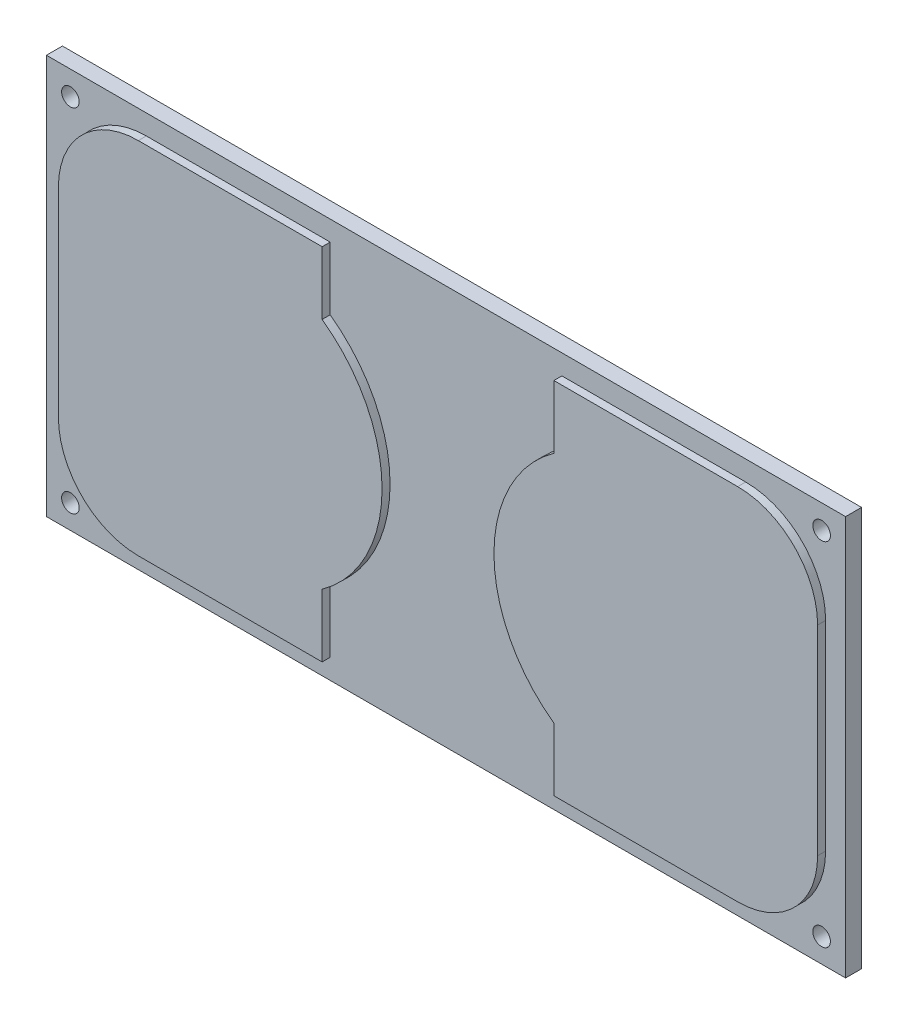
ISO-10303-21;
HEADER;
FILE_DESCRIPTION(('STEP AP214'),'2;1');
FILE_NAME('part.step','',(''),(''),'','','');
FILE_SCHEMA(('AUTOMOTIVE_DESIGN { 1 0 10303 214 1 1 1 1 }'));
ENDSEC;
DATA;
#1=APPLICATION_CONTEXT('core data for automotive mechanical design processes');
#2=APPLICATION_PROTOCOL_DEFINITION('international standard','automotive_design',2000,#1);
#3=PRODUCT_CONTEXT('',#1,'mechanical');
#4=PRODUCT('Part','Part','',(#3));
#5=PRODUCT_RELATED_PRODUCT_CATEGORY('part','',(#4));
#6=PRODUCT_DEFINITION_FORMATION('','',#4);
#7=PRODUCT_DEFINITION_CONTEXT('part definition',#1,'design');
#8=PRODUCT_DEFINITION('design','',#6,#7);
#9=PRODUCT_DEFINITION_SHAPE('','',#8);
#10=(LENGTH_UNIT() NAMED_UNIT(*) SI_UNIT(.MILLI.,.METRE.));
#11=(NAMED_UNIT(*) PLANE_ANGLE_UNIT() SI_UNIT($,.RADIAN.));
#12=(NAMED_UNIT(*) SI_UNIT($,.STERADIAN.) SOLID_ANGLE_UNIT());
#13=UNCERTAINTY_MEASURE_WITH_UNIT(LENGTH_MEASURE(1.E-05),#10,'distance_accuracy_value','');
#14=(GEOMETRIC_REPRESENTATION_CONTEXT(3) GLOBAL_UNCERTAINTY_ASSIGNED_CONTEXT((#13)) GLOBAL_UNIT_ASSIGNED_CONTEXT((#10,
#11,#12)) REPRESENTATION_CONTEXT('',''));
#15=CARTESIAN_POINT('',(0.,0.,0.));
#16=DIRECTION('',(0.,0.,1.));
#17=DIRECTION('',(1.,0.,0.));
#18=AXIS2_PLACEMENT_3D('',#15,#16,#17);
#19=CARTESIAN_POINT('',(0.,0.,2.));
#20=DIRECTION('',(0.,0.,-1.));
#21=DIRECTION('',(-1.,0.,0.));
#22=AXIS2_PLACEMENT_3D('',#19,#20,#21);
#23=PLANE('',#22);
#24=DIRECTION('',(0.,1.,0.));
#25=VECTOR('',#24,1.);
#26=CARTESIAN_POINT('',(35.5,2.5,2.));
#27=LINE('',#26,#25);
#28=CARTESIAN_POINT('',(35.5,2.5,2.));
#29=VERTEX_POINT('',#28);
#30=CARTESIAN_POINT('',(35.5,10.3798084827866,2.));
#31=VERTEX_POINT('',#30);
#32=EDGE_CURVE('E193',#29,#31,#27,.T.);
#33=ORIENTED_EDGE('',*,*,#32,.F.);
#34=DIRECTION('',(1.,0.,0.));
#35=VECTOR('',#34,1.);
#36=CARTESIAN_POINT('',(12.5000000000001,2.5,2.));
#37=LINE('',#36,#35);
#38=CARTESIAN_POINT('',(12.5000000000001,2.5,2.));
#39=VERTEX_POINT('',#38);
#40=EDGE_CURVE('E206',#39,#29,#37,.T.);
#41=ORIENTED_EDGE('',*,*,#40,.F.);
#42=CARTESIAN_POINT('',(12.5,12.5,2.));
#43=DIRECTION('',(0.,0.,1.));
#44=DIRECTION('',(1.,0.,0.));
#45=AXIS2_PLACEMENT_3D('',#42,#43,#44);
#46=CIRCLE('',#45,10.);
#47=CARTESIAN_POINT('',(2.5,12.5,2.));
#48=VERTEX_POINT('',#47);
#49=EDGE_CURVE('E235',#48,#39,#46,.T.);
#50=ORIENTED_EDGE('',*,*,#49,.F.);
#51=DIRECTION('',(0.,-1.,0.));
#52=VECTOR('',#51,1.);
#53=CARTESIAN_POINT('',(2.5,37.4999999999999,2.));
#54=LINE('',#53,#52);
#55=CARTESIAN_POINT('',(2.5,37.4999999999999,2.));
#56=VERTEX_POINT('',#55);
#57=EDGE_CURVE('E232',#56,#48,#54,.T.);
#58=ORIENTED_EDGE('',*,*,#57,.F.);
#59=CARTESIAN_POINT('',(12.5,37.5,2.));
#60=DIRECTION('',(0.,0.,1.));
#61=DIRECTION('',(-1.,0.,0.));
#62=AXIS2_PLACEMENT_3D('',#59,#60,#61);
#63=CIRCLE('',#62,9.99999999999999);
#64=CARTESIAN_POINT('',(12.5000000000001,47.5,2.));
#65=VERTEX_POINT('',#64);
#66=EDGE_CURVE('E229',#65,#56,#63,.T.);
#67=ORIENTED_EDGE('',*,*,#66,.F.);
#68=DIRECTION('',(-1.,0.,0.));
#69=VECTOR('',#68,1.);
#70=CARTESIAN_POINT('',(35.5,47.5,2.));
#71=LINE('',#70,#69);
#72=CARTESIAN_POINT('',(35.5,47.5,2.));
#73=VERTEX_POINT('',#72);
#74=EDGE_CURVE('E226',#73,#65,#71,.T.);
#75=ORIENTED_EDGE('',*,*,#74,.F.);
#76=DIRECTION('',(0.,1.,0.));
#77=VECTOR('',#76,1.);
#78=CARTESIAN_POINT('',(35.5,39.6201915172134,2.));
#79=LINE('',#78,#77);
#80=CARTESIAN_POINT('',(35.5,39.6201915172134,2.));
#81=VERTEX_POINT('',#80);
#82=EDGE_CURVE('E223',#81,#73,#79,.T.);
#83=ORIENTED_EDGE('',*,*,#82,.F.);
#84=CARTESIAN_POINT('',(25.,25.,2.));
#85=DIRECTION('',(0.,0.,1.));
#86=DIRECTION('',(-1.,0.,0.));
#87=AXIS2_PLACEMENT_3D('',#84,#85,#86);
#88=CIRCLE('',#87,18.);
#89=EDGE_CURVE('E196',#31,#81,#88,.T.);
#90=ORIENTED_EDGE('',*,*,#89,.F.);
#91=EDGE_LOOP('',(#33,#41,#50,#58,#67,#75,#83,#90));
#92=FACE_BOUND('',#91,.T.);
#93=DIRECTION('',(0.,-1.,0.));
#94=VECTOR('',#93,1.);
#95=CARTESIAN_POINT('',(0.,0.,2.));
#96=LINE('',#95,#94);
#97=CARTESIAN_POINT('',(0.,50.,2.));
#98=VERTEX_POINT('',#97);
#99=CARTESIAN_POINT('',(0.,0.,2.));
#100=VERTEX_POINT('',#99);
#101=EDGE_CURVE('E288',#98,#100,#96,.T.);
#102=ORIENTED_EDGE('',*,*,#101,.T.);
#103=DIRECTION('',(1.,0.,0.));
#104=VECTOR('',#103,1.);
#105=CARTESIAN_POINT('',(0.,0.,2.));
#106=LINE('',#105,#104);
#107=CARTESIAN_POINT('',(100.,0.,2.));
#108=VERTEX_POINT('',#107);
#109=EDGE_CURVE('E291',#100,#108,#106,.T.);
#110=ORIENTED_EDGE('',*,*,#109,.T.);
#111=DIRECTION('',(0.,1.,0.));
#112=VECTOR('',#111,1.);
#113=CARTESIAN_POINT('',(100.,0.,2.));
#114=LINE('',#113,#112);
#115=CARTESIAN_POINT('',(100.,50.,2.));
#116=VERTEX_POINT('',#115);
#117=EDGE_CURVE('E294',#108,#116,#114,.T.);
#118=ORIENTED_EDGE('',*,*,#117,.T.);
#119=DIRECTION('',(-1.,0.,0.));
#120=VECTOR('',#119,1.);
#121=CARTESIAN_POINT('',(0.,50.,2.));
#122=LINE('',#121,#120);
#123=EDGE_CURVE('E296',#116,#98,#122,.T.);
#124=ORIENTED_EDGE('',*,*,#123,.T.);
#125=EDGE_LOOP('',(#102,#110,#118,#124));
#126=FACE_BOUND('',#125,.T.);
#127=CARTESIAN_POINT('',(3.,47.,2.));
#128=DIRECTION('',(0.,0.,1.));
#129=DIRECTION('',(1.,0.,0.));
#130=AXIS2_PLACEMENT_3D('',#127,#128,#129);
#131=CIRCLE('',#130,1.1);
#132=CARTESIAN_POINT('',(4.1,47.,2.));
#133=VERTEX_POINT('',#132);
#134=EDGE_CURVE('E282',#133,#133,#131,.T.);
#135=ORIENTED_EDGE('',*,*,#134,.F.);
#136=EDGE_LOOP('',(#135));
#137=FACE_BOUND('',#136,.T.);
#138=CARTESIAN_POINT('',(97.,47.,2.));
#139=DIRECTION('',(0.,0.,1.));
#140=DIRECTION('',(-1.,0.,0.));
#141=AXIS2_PLACEMENT_3D('',#138,#139,#140);
#142=CIRCLE('',#141,1.10000000000001);
#143=CARTESIAN_POINT('',(95.9,47.,2.));
#144=VERTEX_POINT('',#143);
#145=EDGE_CURVE('E276',#144,#144,#142,.T.);
#146=ORIENTED_EDGE('',*,*,#145,.F.);
#147=EDGE_LOOP('',(#146));
#148=FACE_BOUND('',#147,.T.);
#149=CARTESIAN_POINT('',(3.,3.,2.));
#150=DIRECTION('',(0.,0.,1.));
#151=DIRECTION('',(-1.,0.,0.));
#152=AXIS2_PLACEMENT_3D('',#149,#150,#151);
#153=CIRCLE('',#152,1.1);
#154=CARTESIAN_POINT('',(1.9,3.,2.));
#155=VERTEX_POINT('',#154);
#156=EDGE_CURVE('E270',#155,#155,#153,.T.);
#157=ORIENTED_EDGE('',*,*,#156,.F.);
#158=EDGE_LOOP('',(#157));
#159=FACE_BOUND('',#158,.T.);
#160=CARTESIAN_POINT('',(97.,3.,2.));
#161=DIRECTION('',(0.,0.,1.));
#162=DIRECTION('',(1.,0.,0.));
#163=AXIS2_PLACEMENT_3D('',#160,#161,#162);
#164=CIRCLE('',#163,1.10000000000001);
#165=CARTESIAN_POINT('',(98.1,3.,2.));
#166=VERTEX_POINT('',#165);
#167=EDGE_CURVE('E264',#166,#166,#164,.T.);
#168=ORIENTED_EDGE('',*,*,#167,.F.);
#169=EDGE_LOOP('',(#168));
#170=FACE_BOUND('',#169,.T.);
#171=CARTESIAN_POINT('',(75.,25.,2.));
#172=DIRECTION('',(0.,0.,1.));
#173=DIRECTION('',(1.,0.,0.));
#174=AXIS2_PLACEMENT_3D('',#171,#172,#173);
#175=CIRCLE('',#174,18.);
#176=CARTESIAN_POINT('',(64.5,39.6201915172134,2.));
#177=VERTEX_POINT('',#176);
#178=CARTESIAN_POINT('',(64.5,10.3798084827866,2.));
#179=VERTEX_POINT('',#178);
#180=EDGE_CURVE('E192',#177,#179,#175,.T.);
#181=ORIENTED_EDGE('',*,*,#180,.F.);
#182=DIRECTION('',(0.,-1.,0.));
#183=VECTOR('',#182,1.);
#184=CARTESIAN_POINT('',(64.5,39.6201915172134,2.));
#185=LINE('',#184,#183);
#186=CARTESIAN_POINT('',(64.5,47.5,2.));
#187=VERTEX_POINT('',#186);
#188=EDGE_CURVE('E189',#187,#177,#185,.T.);
#189=ORIENTED_EDGE('',*,*,#188,.F.);
#190=DIRECTION('',(-1.,0.,0.));
#191=VECTOR('',#190,1.);
#192=CARTESIAN_POINT('',(64.5,47.5,2.));
#193=LINE('',#192,#191);
#194=CARTESIAN_POINT('',(87.4999999999999,47.5,2.));
#195=VERTEX_POINT('',#194);
#196=EDGE_CURVE('E381',#195,#187,#193,.T.);
#197=ORIENTED_EDGE('',*,*,#196,.F.);
#198=CARTESIAN_POINT('',(87.5,37.5,2.));
#199=DIRECTION('',(0.,0.,1.));
#200=DIRECTION('',(1.,0.,0.));
#201=AXIS2_PLACEMENT_3D('',#198,#199,#200);
#202=CIRCLE('',#201,10.);
#203=CARTESIAN_POINT('',(97.5,37.4999999999999,2.));
#204=VERTEX_POINT('',#203);
#205=EDGE_CURVE('E415',#204,#195,#202,.T.);
#206=ORIENTED_EDGE('',*,*,#205,.F.);
#207=DIRECTION('',(0.,1.,0.));
#208=VECTOR('',#207,1.);
#209=CARTESIAN_POINT('',(97.5,37.4999999999999,2.));
#210=LINE('',#209,#208);
#211=CARTESIAN_POINT('',(97.5,12.5000000000001,2.));
#212=VERTEX_POINT('',#211);
#213=EDGE_CURVE('E409',#212,#204,#210,.T.);
#214=ORIENTED_EDGE('',*,*,#213,.F.);
#215=CARTESIAN_POINT('',(87.5,12.5,2.));
#216=DIRECTION('',(0.,0.,1.));
#217=DIRECTION('',(-1.,0.,0.));
#218=AXIS2_PLACEMENT_3D('',#215,#216,#217);
#219=CIRCLE('',#218,10.);
#220=CARTESIAN_POINT('',(87.4999999999999,2.5,2.));
#221=VERTEX_POINT('',#220);
#222=EDGE_CURVE('E404',#221,#212,#219,.T.);
#223=ORIENTED_EDGE('',*,*,#222,.F.);
#224=DIRECTION('',(1.,0.,0.));
#225=VECTOR('',#224,1.);
#226=CARTESIAN_POINT('',(87.4999999999999,2.5,2.));
#227=LINE('',#226,#225);
#228=CARTESIAN_POINT('',(64.5,2.5,2.));
#229=VERTEX_POINT('',#228);
#230=EDGE_CURVE('E55',#229,#221,#227,.T.);
#231=ORIENTED_EDGE('',*,*,#230,.F.);
#232=DIRECTION('',(0.,-1.,0.));
#233=VECTOR('',#232,1.);
#234=CARTESIAN_POINT('',(64.5,2.5,2.));
#235=LINE('',#234,#233);
#236=EDGE_CURVE('E50',#179,#229,#235,.T.);
#237=ORIENTED_EDGE('',*,*,#236,.F.);
#238=EDGE_LOOP('',(#181,#189,#197,#206,#214,#223,#231,#237));
#239=FACE_BOUND('',#238,.T.);
#240=ADVANCED_FACE('F35',(#92,#126,#137,#148,#159,#170,#239),#23,.F.);
#241=CARTESIAN_POINT('',(0.,0.,0.));
#242=DIRECTION('',(0.,0.,-1.));
#243=DIRECTION('',(-1.,0.,0.));
#244=AXIS2_PLACEMENT_3D('',#241,#242,#243);
#245=PLANE('',#244);
#246=CARTESIAN_POINT('',(3.,3.,0.));
#247=DIRECTION('',(0.,0.,1.));
#248=DIRECTION('',(-1.,0.,0.));
#249=AXIS2_PLACEMENT_3D('',#246,#247,#248);
#250=CIRCLE('',#249,1.1);
#251=CARTESIAN_POINT('',(1.9,3.,0.));
#252=VERTEX_POINT('',#251);
#253=EDGE_CURVE('E267',#252,#252,#250,.T.);
#254=ORIENTED_EDGE('',*,*,#253,.T.);
#255=EDGE_LOOP('',(#254));
#256=FACE_BOUND('',#255,.T.);
#257=CARTESIAN_POINT('',(3.,47.,0.));
#258=DIRECTION('',(0.,0.,1.));
#259=DIRECTION('',(1.,0.,0.));
#260=AXIS2_PLACEMENT_3D('',#257,#258,#259);
#261=CIRCLE('',#260,1.1);
#262=CARTESIAN_POINT('',(4.1,47.,0.));
#263=VERTEX_POINT('',#262);
#264=EDGE_CURVE('E279',#263,#263,#261,.T.);
#265=ORIENTED_EDGE('',*,*,#264,.T.);
#266=EDGE_LOOP('',(#265));
#267=FACE_BOUND('',#266,.T.);
#268=DIRECTION('',(0.,-1.,0.));
#269=VECTOR('',#268,1.);
#270=CARTESIAN_POINT('',(0.,0.,0.));
#271=LINE('',#270,#269);
#272=CARTESIAN_POINT('',(0.,50.,0.));
#273=VERTEX_POINT('',#272);
#274=CARTESIAN_POINT('',(0.,0.,0.));
#275=VERTEX_POINT('',#274);
#276=EDGE_CURVE('E285',#273,#275,#271,.T.);
#277=ORIENTED_EDGE('',*,*,#276,.F.);
#278=DIRECTION('',(-1.,0.,0.));
#279=VECTOR('',#278,1.);
#280=CARTESIAN_POINT('',(0.,50.,0.));
#281=LINE('',#280,#279);
#282=CARTESIAN_POINT('',(100.,50.,0.));
#283=VERTEX_POINT('',#282);
#284=EDGE_CURVE('E292',#283,#273,#281,.T.);
#285=ORIENTED_EDGE('',*,*,#284,.F.);
#286=DIRECTION('',(0.,1.,0.));
#287=VECTOR('',#286,1.);
#288=CARTESIAN_POINT('',(100.,0.,0.));
#289=LINE('',#288,#287);
#290=CARTESIAN_POINT('',(100.,0.,0.));
#291=VERTEX_POINT('',#290);
#292=EDGE_CURVE('E303',#291,#283,#289,.T.);
#293=ORIENTED_EDGE('',*,*,#292,.F.);
#294=DIRECTION('',(1.,0.,0.));
#295=VECTOR('',#294,1.);
#296=CARTESIAN_POINT('',(0.,0.,0.));
#297=LINE('',#296,#295);
#298=EDGE_CURVE('E301',#275,#291,#297,.T.);
#299=ORIENTED_EDGE('',*,*,#298,.F.);
#300=EDGE_LOOP('',(#277,#285,#293,#299));
#301=FACE_BOUND('',#300,.T.);
#302=CARTESIAN_POINT('',(97.,47.,0.));
#303=DIRECTION('',(0.,0.,1.));
#304=DIRECTION('',(-1.,0.,0.));
#305=AXIS2_PLACEMENT_3D('',#302,#303,#304);
#306=CIRCLE('',#305,1.10000000000001);
#307=CARTESIAN_POINT('',(95.9,47.,0.));
#308=VERTEX_POINT('',#307);
#309=EDGE_CURVE('E273',#308,#308,#306,.T.);
#310=ORIENTED_EDGE('',*,*,#309,.T.);
#311=EDGE_LOOP('',(#310));
#312=FACE_BOUND('',#311,.T.);
#313=CARTESIAN_POINT('',(97.,3.,0.));
#314=DIRECTION('',(0.,0.,1.));
#315=DIRECTION('',(1.,0.,0.));
#316=AXIS2_PLACEMENT_3D('',#313,#314,#315);
#317=CIRCLE('',#316,1.10000000000001);
#318=CARTESIAN_POINT('',(98.1,3.,0.));
#319=VERTEX_POINT('',#318);
#320=EDGE_CURVE('E263',#319,#319,#317,.T.);
#321=ORIENTED_EDGE('',*,*,#320,.T.);
#322=EDGE_LOOP('',(#321));
#323=FACE_BOUND('',#322,.T.);
#324=ADVANCED_FACE('F321',(#256,#267,#301,#312,#323),#245,.T.);
#325=CARTESIAN_POINT('',(0.,0.,2.));
#326=DIRECTION('',(1.,0.,0.));
#327=DIRECTION('',(0.,0.,-1.));
#328=AXIS2_PLACEMENT_3D('',#325,#326,#327);
#329=PLANE('',#328);
#330=ORIENTED_EDGE('',*,*,#276,.T.);
#331=DIRECTION('',(0.,0.,-1.));
#332=VECTOR('',#331,1.);
#333=CARTESIAN_POINT('',(0.,0.,2.));
#334=LINE('',#333,#332);
#335=EDGE_CURVE('E11',#100,#275,#334,.T.);
#336=ORIENTED_EDGE('',*,*,#335,.F.);
#337=ORIENTED_EDGE('',*,*,#101,.F.);
#338=DIRECTION('',(0.,0.,-1.));
#339=VECTOR('',#338,1.);
#340=CARTESIAN_POINT('',(0.,50.,2.));
#341=LINE('',#340,#339);
#342=EDGE_CURVE('E298',#98,#273,#341,.T.);
#343=ORIENTED_EDGE('',*,*,#342,.T.);
#344=EDGE_LOOP('',(#330,#336,#337,#343));
#345=FACE_BOUND('',#344,.T.);
#346=ADVANCED_FACE('F37',(#345),#329,.F.);
#347=CARTESIAN_POINT('',(0.,0.,2.));
#348=DIRECTION('',(0.,1.,0.));
#349=DIRECTION('',(0.,0.,1.));
#350=AXIS2_PLACEMENT_3D('',#347,#348,#349);
#351=PLANE('',#350);
#352=ORIENTED_EDGE('',*,*,#298,.T.);
#353=DIRECTION('',(0.,0.,-1.));
#354=VECTOR('',#353,1.);
#355=CARTESIAN_POINT('',(100.,0.,2.));
#356=LINE('',#355,#354);
#357=EDGE_CURVE('E43',#108,#291,#356,.T.);
#358=ORIENTED_EDGE('',*,*,#357,.F.);
#359=ORIENTED_EDGE('',*,*,#109,.F.);
#360=ORIENTED_EDGE('',*,*,#335,.T.);
#361=EDGE_LOOP('',(#352,#358,#359,#360));
#362=FACE_BOUND('',#361,.T.);
#363=ADVANCED_FACE('F332',(#362),#351,.F.);
#364=CARTESIAN_POINT('',(100.,0.,2.));
#365=DIRECTION('',(-1.,0.,0.));
#366=DIRECTION('',(0.,0.,1.));
#367=AXIS2_PLACEMENT_3D('',#364,#365,#366);
#368=PLANE('',#367);
#369=ORIENTED_EDGE('',*,*,#292,.T.);
#370=DIRECTION('',(0.,0.,-1.));
#371=VECTOR('',#370,1.);
#372=CARTESIAN_POINT('',(100.,50.,2.));
#373=LINE('',#372,#371);
#374=EDGE_CURVE('E308',#116,#283,#373,.T.);
#375=ORIENTED_EDGE('',*,*,#374,.F.);
#376=ORIENTED_EDGE('',*,*,#117,.F.);
#377=ORIENTED_EDGE('',*,*,#357,.T.);
#378=EDGE_LOOP('',(#369,#375,#376,#377));
#379=FACE_BOUND('',#378,.T.);
#380=ADVANCED_FACE('F315',(#379),#368,.F.);
#381=CARTESIAN_POINT('',(0.,50.,2.));
#382=DIRECTION('',(0.,-1.,0.));
#383=DIRECTION('',(0.,0.,-1.));
#384=AXIS2_PLACEMENT_3D('',#381,#382,#383);
#385=PLANE('',#384);
#386=ORIENTED_EDGE('',*,*,#284,.T.);
#387=ORIENTED_EDGE('',*,*,#342,.F.);
#388=ORIENTED_EDGE('',*,*,#123,.F.);
#389=ORIENTED_EDGE('',*,*,#374,.T.);
#390=EDGE_LOOP('',(#386,#387,#388,#389));
#391=FACE_BOUND('',#390,.T.);
#392=ADVANCED_FACE('F325',(#391),#385,.F.);
#393=CARTESIAN_POINT('',(3.,47.,2.));
#394=DIRECTION('',(0.,0.,-1.));
#395=DIRECTION('',(-1.,0.,0.));
#396=AXIS2_PLACEMENT_3D('',#393,#394,#395);
#397=CYLINDRICAL_SURFACE('',#396,1.1);
#398=ORIENTED_EDGE('',*,*,#134,.T.);
#399=EDGE_LOOP('',(#398));
#400=FACE_BOUND('',#399,.T.);
#401=ORIENTED_EDGE('',*,*,#264,.F.);
#402=EDGE_LOOP('',(#401));
#403=FACE_BOUND('',#402,.T.);
#404=ADVANCED_FACE('F348',(#400,#403),#397,.F.);
#405=CARTESIAN_POINT('',(97.,47.,2.));
#406=DIRECTION('',(0.,0.,-1.));
#407=DIRECTION('',(-1.,0.,0.));
#408=AXIS2_PLACEMENT_3D('',#405,#406,#407);
#409=CYLINDRICAL_SURFACE('',#408,1.10000000000001);
#410=ORIENTED_EDGE('',*,*,#145,.T.);
#411=EDGE_LOOP('',(#410));
#412=FACE_BOUND('',#411,.T.);
#413=ORIENTED_EDGE('',*,*,#309,.F.);
#414=EDGE_LOOP('',(#413));
#415=FACE_BOUND('',#414,.T.);
#416=ADVANCED_FACE('F355',(#412,#415),#409,.F.);
#417=CARTESIAN_POINT('',(3.,3.,2.));
#418=DIRECTION('',(0.,0.,-1.));
#419=DIRECTION('',(-1.,0.,0.));
#420=AXIS2_PLACEMENT_3D('',#417,#418,#419);
#421=CYLINDRICAL_SURFACE('',#420,1.1);
#422=ORIENTED_EDGE('',*,*,#156,.T.);
#423=EDGE_LOOP('',(#422));
#424=FACE_BOUND('',#423,.T.);
#425=ORIENTED_EDGE('',*,*,#253,.F.);
#426=EDGE_LOOP('',(#425));
#427=FACE_BOUND('',#426,.T.);
#428=ADVANCED_FACE('F360',(#424,#427),#421,.F.);
#429=CARTESIAN_POINT('',(97.,3.,2.));
#430=DIRECTION('',(0.,0.,-1.));
#431=DIRECTION('',(-1.,0.,0.));
#432=AXIS2_PLACEMENT_3D('',#429,#430,#431);
#433=CYLINDRICAL_SURFACE('',#432,1.10000000000001);
#434=ORIENTED_EDGE('',*,*,#167,.T.);
#435=EDGE_LOOP('',(#434));
#436=FACE_BOUND('',#435,.T.);
#437=ORIENTED_EDGE('',*,*,#320,.F.);
#438=EDGE_LOOP('',(#437));
#439=FACE_BOUND('',#438,.T.);
#440=ADVANCED_FACE('F486',(#436,#439),#433,.F.);
#441=CARTESIAN_POINT('',(35.5,2.5,3.));
#442=DIRECTION('',(-1.,0.,0.));
#443=DIRECTION('',(0.,-1.,0.));
#444=AXIS2_PLACEMENT_3D('',#441,#442,#443);
#445=PLANE('',#444);
#446=ORIENTED_EDGE('',*,*,#32,.T.);
#447=DIRECTION('',(0.,0.,-1.));
#448=VECTOR('',#447,1.);
#449=CARTESIAN_POINT('',(35.5,10.3798084827866,3.));
#450=LINE('',#449,#448);
#451=CARTESIAN_POINT('',(35.5,10.3798084827866,3.));
#452=VERTEX_POINT('',#451);
#453=EDGE_CURVE('E260',#452,#31,#450,.T.);
#454=ORIENTED_EDGE('',*,*,#453,.F.);
#455=DIRECTION('',(0.,1.,0.));
#456=VECTOR('',#455,1.);
#457=CARTESIAN_POINT('',(35.5,2.5,3.));
#458=LINE('',#457,#456);
#459=CARTESIAN_POINT('',(35.5,2.5,3.));
#460=VERTEX_POINT('',#459);
#461=EDGE_CURVE('E202',#460,#452,#458,.T.);
#462=ORIENTED_EDGE('',*,*,#461,.F.);
#463=DIRECTION('',(0.,0.,-1.));
#464=VECTOR('',#463,1.);
#465=CARTESIAN_POINT('',(35.5,2.5,3.));
#466=LINE('',#465,#464);
#467=EDGE_CURVE('E219',#460,#29,#466,.T.);
#468=ORIENTED_EDGE('',*,*,#467,.T.);
#469=EDGE_LOOP('',(#446,#454,#462,#468));
#470=FACE_BOUND('',#469,.T.);
#471=ADVANCED_FACE('F482',(#470),#445,.F.);
#472=CARTESIAN_POINT('',(25.,25.,3.));
#473=DIRECTION('',(0.,0.,-1.));
#474=DIRECTION('',(-1.,0.,0.));
#475=AXIS2_PLACEMENT_3D('',#472,#473,#474);
#476=CYLINDRICAL_SURFACE('',#475,18.);
#477=ORIENTED_EDGE('',*,*,#89,.T.);
#478=DIRECTION('',(0.,0.,-1.));
#479=VECTOR('',#478,1.);
#480=CARTESIAN_POINT('',(35.5,39.6201915172134,3.));
#481=LINE('',#480,#479);
#482=CARTESIAN_POINT('',(35.5,39.6201915172134,3.));
#483=VERTEX_POINT('',#482);
#484=EDGE_CURVE('E257',#483,#81,#481,.T.);
#485=ORIENTED_EDGE('',*,*,#484,.F.);
#486=CARTESIAN_POINT('',(25.,25.,3.));
#487=DIRECTION('',(0.,0.,1.));
#488=DIRECTION('',(-1.,0.,0.));
#489=AXIS2_PLACEMENT_3D('',#486,#487,#488);
#490=CIRCLE('',#489,18.);
#491=EDGE_CURVE('E205',#452,#483,#490,.T.);
#492=ORIENTED_EDGE('',*,*,#491,.F.);
#493=ORIENTED_EDGE('',*,*,#453,.T.);
#494=EDGE_LOOP('',(#477,#485,#492,#493));
#495=FACE_BOUND('',#494,.T.);
#496=ADVANCED_FACE('F478',(#495),#476,.T.);
#497=CARTESIAN_POINT('',(35.5,39.6201915172134,3.));
#498=DIRECTION('',(-1.,0.,0.));
#499=DIRECTION('',(0.,-1.,0.));
#500=AXIS2_PLACEMENT_3D('',#497,#498,#499);
#501=PLANE('',#500);
#502=ORIENTED_EDGE('',*,*,#82,.T.);
#503=DIRECTION('',(0.,0.,-1.));
#504=VECTOR('',#503,1.);
#505=CARTESIAN_POINT('',(35.5,47.5,3.));
#506=LINE('',#505,#504);
#507=CARTESIAN_POINT('',(35.5,47.5,3.));
#508=VERTEX_POINT('',#507);
#509=EDGE_CURVE('E254',#508,#73,#506,.T.);
#510=ORIENTED_EDGE('',*,*,#509,.F.);
#511=DIRECTION('',(0.,1.,0.));
#512=VECTOR('',#511,1.);
#513=CARTESIAN_POINT('',(35.5,39.6201915172134,3.));
#514=LINE('',#513,#512);
#515=EDGE_CURVE('E208',#483,#508,#514,.T.);
#516=ORIENTED_EDGE('',*,*,#515,.F.);
#517=ORIENTED_EDGE('',*,*,#484,.T.);
#518=EDGE_LOOP('',(#502,#510,#516,#517));
#519=FACE_BOUND('',#518,.T.);
#520=ADVANCED_FACE('F474',(#519),#501,.F.);
#521=CARTESIAN_POINT('',(35.5,47.5,3.));
#522=DIRECTION('',(0.,-1.,0.));
#523=DIRECTION('',(1.,0.,0.));
#524=AXIS2_PLACEMENT_3D('',#521,#522,#523);
#525=PLANE('',#524);
#526=ORIENTED_EDGE('',*,*,#74,.T.);
#527=DIRECTION('',(0.,0.,-1.));
#528=VECTOR('',#527,1.);
#529=CARTESIAN_POINT('',(12.5000000000001,47.5,3.));
#530=LINE('',#529,#528);
#531=CARTESIAN_POINT('',(12.5000000000001,47.5,3.));
#532=VERTEX_POINT('',#531);
#533=EDGE_CURVE('E251',#532,#65,#530,.T.);
#534=ORIENTED_EDGE('',*,*,#533,.F.);
#535=DIRECTION('',(-1.,0.,0.));
#536=VECTOR('',#535,1.);
#537=CARTESIAN_POINT('',(35.5,47.5,3.));
#538=LINE('',#537,#536);
#539=EDGE_CURVE('E210',#508,#532,#538,.T.);
#540=ORIENTED_EDGE('',*,*,#539,.F.);
#541=ORIENTED_EDGE('',*,*,#509,.T.);
#542=EDGE_LOOP('',(#526,#534,#540,#541));
#543=FACE_BOUND('',#542,.T.);
#544=ADVANCED_FACE('F470',(#543),#525,.F.);
#545=CARTESIAN_POINT('',(12.5,37.5,3.));
#546=DIRECTION('',(0.,0.,-1.));
#547=DIRECTION('',(-1.,0.,0.));
#548=AXIS2_PLACEMENT_3D('',#545,#546,#547);
#549=CYLINDRICAL_SURFACE('',#548,9.99999999999999);
#550=ORIENTED_EDGE('',*,*,#66,.T.);
#551=DIRECTION('',(0.,0.,-1.));
#552=VECTOR('',#551,1.);
#553=CARTESIAN_POINT('',(2.5,37.4999999999999,3.));
#554=LINE('',#553,#552);
#555=CARTESIAN_POINT('',(2.5,37.4999999999999,3.));
#556=VERTEX_POINT('',#555);
#557=EDGE_CURVE('E248',#556,#56,#554,.T.);
#558=ORIENTED_EDGE('',*,*,#557,.F.);
#559=CARTESIAN_POINT('',(12.5,37.5,3.));
#560=DIRECTION('',(0.,0.,1.));
#561=DIRECTION('',(-1.,0.,0.));
#562=AXIS2_PLACEMENT_3D('',#559,#560,#561);
#563=CIRCLE('',#562,9.99999999999999);
#564=EDGE_CURVE('E212',#532,#556,#563,.T.);
#565=ORIENTED_EDGE('',*,*,#564,.F.);
#566=ORIENTED_EDGE('',*,*,#533,.T.);
#567=EDGE_LOOP('',(#550,#558,#565,#566));
#568=FACE_BOUND('',#567,.T.);
#569=ADVANCED_FACE('F466',(#568),#549,.T.);
#570=CARTESIAN_POINT('',(2.5,37.4999999999999,3.));
#571=DIRECTION('',(1.,0.,0.));
#572=DIRECTION('',(0.,1.,0.));
#573=AXIS2_PLACEMENT_3D('',#570,#571,#572);
#574=PLANE('',#573);
#575=ORIENTED_EDGE('',*,*,#57,.T.);
#576=DIRECTION('',(0.,0.,-1.));
#577=VECTOR('',#576,1.);
#578=CARTESIAN_POINT('',(2.5,12.5000000000001,3.));
#579=LINE('',#578,#577);
#580=CARTESIAN_POINT('',(2.5,12.5000000000001,3.));
#581=VERTEX_POINT('',#580);
#582=EDGE_CURVE('E245',#581,#48,#579,.T.);
#583=ORIENTED_EDGE('',*,*,#582,.F.);
#584=DIRECTION('',(0.,-1.,0.));
#585=VECTOR('',#584,1.);
#586=CARTESIAN_POINT('',(2.5,37.4999999999999,3.));
#587=LINE('',#586,#585);
#588=EDGE_CURVE('E214',#556,#581,#587,.T.);
#589=ORIENTED_EDGE('',*,*,#588,.F.);
#590=ORIENTED_EDGE('',*,*,#557,.T.);
#591=EDGE_LOOP('',(#575,#583,#589,#590));
#592=FACE_BOUND('',#591,.T.);
#593=ADVANCED_FACE('F462',(#592),#574,.F.);
#594=CARTESIAN_POINT('',(12.5,12.5,3.));
#595=DIRECTION('',(0.,0.,-1.));
#596=DIRECTION('',(-1.,0.,0.));
#597=AXIS2_PLACEMENT_3D('',#594,#595,#596);
#598=CYLINDRICAL_SURFACE('',#597,10.);
#599=ORIENTED_EDGE('',*,*,#49,.T.);
#600=DIRECTION('',(0.,0.,-1.));
#601=VECTOR('',#600,1.);
#602=CARTESIAN_POINT('',(12.5000000000001,2.5,3.));
#603=LINE('',#602,#601);
#604=CARTESIAN_POINT('',(12.5000000000001,2.5,3.));
#605=VERTEX_POINT('',#604);
#606=EDGE_CURVE('E242',#605,#39,#603,.T.);
#607=ORIENTED_EDGE('',*,*,#606,.F.);
#608=CARTESIAN_POINT('',(12.5,12.5,3.));
#609=DIRECTION('',(0.,0.,1.));
#610=DIRECTION('',(1.,0.,0.));
#611=AXIS2_PLACEMENT_3D('',#608,#609,#610);
#612=CIRCLE('',#611,10.);
#613=EDGE_CURVE('E216',#581,#605,#612,.T.);
#614=ORIENTED_EDGE('',*,*,#613,.F.);
#615=ORIENTED_EDGE('',*,*,#582,.T.);
#616=EDGE_LOOP('',(#599,#607,#614,#615));
#617=FACE_BOUND('',#616,.T.);
#618=ADVANCED_FACE('F458',(#617),#598,.T.);
#619=CARTESIAN_POINT('',(12.5000000000001,2.5,3.));
#620=DIRECTION('',(0.,1.,0.));
#621=DIRECTION('',(0.,0.,1.));
#622=AXIS2_PLACEMENT_3D('',#619,#620,#621);
#623=PLANE('',#622);
#624=ORIENTED_EDGE('',*,*,#40,.T.);
#625=ORIENTED_EDGE('',*,*,#467,.F.);
#626=DIRECTION('',(1.,0.,0.));
#627=VECTOR('',#626,1.);
#628=CARTESIAN_POINT('',(12.5000000000001,2.5,3.));
#629=LINE('',#628,#627);
#630=EDGE_CURVE('E218',#605,#460,#629,.T.);
#631=ORIENTED_EDGE('',*,*,#630,.F.);
#632=ORIENTED_EDGE('',*,*,#606,.T.);
#633=EDGE_LOOP('',(#624,#625,#631,#632));
#634=FACE_BOUND('',#633,.T.);
#635=ADVANCED_FACE('F454',(#634),#623,.F.);
#636=CARTESIAN_POINT('',(25.,25.,3.));
#637=DIRECTION('',(0.,0.,-1.));
#638=DIRECTION('',(-1.,0.,0.));
#639=AXIS2_PLACEMENT_3D('',#636,#637,#638);
#640=PLANE('',#639);
#641=ORIENTED_EDGE('',*,*,#461,.T.);
#642=ORIENTED_EDGE('',*,*,#491,.T.);
#643=ORIENTED_EDGE('',*,*,#515,.T.);
#644=ORIENTED_EDGE('',*,*,#539,.T.);
#645=ORIENTED_EDGE('',*,*,#564,.T.);
#646=ORIENTED_EDGE('',*,*,#588,.T.);
#647=ORIENTED_EDGE('',*,*,#613,.T.);
#648=ORIENTED_EDGE('',*,*,#630,.T.);
#649=EDGE_LOOP('',(#641,#642,#643,#644,#645,#646,#647,#648));
#650=FACE_BOUND('',#649,.T.);
#651=ADVANCED_FACE('F451',(#650),#640,.F.);
#652=CARTESIAN_POINT('',(75.,25.,3.));
#653=DIRECTION('',(0.,0.,-1.));
#654=DIRECTION('',(-1.,0.,0.));
#655=AXIS2_PLACEMENT_3D('',#652,#653,#654);
#656=CYLINDRICAL_SURFACE('',#655,18.);
#657=ORIENTED_EDGE('',*,*,#180,.T.);
#658=DIRECTION('',(0.,0.,-1.));
#659=VECTOR('',#658,1.);
#660=CARTESIAN_POINT('',(64.5,10.3798084827866,3.));
#661=LINE('',#660,#659);
#662=CARTESIAN_POINT('',(64.5,10.3798084827866,3.));
#663=VERTEX_POINT('',#662);
#664=EDGE_CURVE('E173',#663,#179,#661,.T.);
#665=ORIENTED_EDGE('',*,*,#664,.F.);
#666=CARTESIAN_POINT('',(75.,25.,3.));
#667=DIRECTION('',(0.,0.,1.));
#668=DIRECTION('',(1.,0.,0.));
#669=AXIS2_PLACEMENT_3D('',#666,#667,#668);
#670=CIRCLE('',#669,18.);
#671=CARTESIAN_POINT('',(64.5,39.6201915172134,3.));
#672=VERTEX_POINT('',#671);
#673=EDGE_CURVE('E180',#672,#663,#670,.T.);
#674=ORIENTED_EDGE('',*,*,#673,.F.);
#675=DIRECTION('',(0.,0.,-1.));
#676=VECTOR('',#675,1.);
#677=CARTESIAN_POINT('',(64.5,39.6201915172134,3.));
#678=LINE('',#677,#676);
#679=EDGE_CURVE('E378',#672,#177,#678,.T.);
#680=ORIENTED_EDGE('',*,*,#679,.T.);
#681=EDGE_LOOP('',(#657,#665,#674,#680));
#682=FACE_BOUND('',#681,.T.);
#683=ADVANCED_FACE('F191',(#682),#656,.T.);
#684=CARTESIAN_POINT('',(64.5,2.5,3.));
#685=DIRECTION('',(1.,0.,0.));
#686=DIRECTION('',(0.,1.,0.));
#687=AXIS2_PLACEMENT_3D('',#684,#685,#686);
#688=PLANE('',#687);
#689=ORIENTED_EDGE('',*,*,#236,.T.);
#690=DIRECTION('',(0.,0.,-1.));
#691=VECTOR('',#690,1.);
#692=CARTESIAN_POINT('',(64.5,2.5,3.));
#693=LINE('',#692,#691);
#694=CARTESIAN_POINT('',(64.5,2.5,3.));
#695=VERTEX_POINT('',#694);
#696=EDGE_CURVE('E176',#695,#229,#693,.T.);
#697=ORIENTED_EDGE('',*,*,#696,.F.);
#698=DIRECTION('',(0.,-1.,0.));
#699=VECTOR('',#698,1.);
#700=CARTESIAN_POINT('',(64.5,2.5,3.));
#701=LINE('',#700,#699);
#702=EDGE_CURVE('E169',#663,#695,#701,.T.);
#703=ORIENTED_EDGE('',*,*,#702,.F.);
#704=ORIENTED_EDGE('',*,*,#664,.T.);
#705=EDGE_LOOP('',(#689,#697,#703,#704));
#706=FACE_BOUND('',#705,.T.);
#707=ADVANCED_FACE('F171',(#706),#688,.F.);
#708=CARTESIAN_POINT('',(87.4999999999999,2.5,3.));
#709=DIRECTION('',(0.,1.,0.));
#710=DIRECTION('',(0.,0.,1.));
#711=AXIS2_PLACEMENT_3D('',#708,#709,#710);
#712=PLANE('',#711);
#713=ORIENTED_EDGE('',*,*,#230,.T.);
#714=DIRECTION('',(0.,0.,-1.));
#715=VECTOR('',#714,1.);
#716=CARTESIAN_POINT('',(87.4999999999999,2.5,3.));
#717=LINE('',#716,#715);
#718=CARTESIAN_POINT('',(87.4999999999999,2.5,3.));
#719=VERTEX_POINT('',#718);
#720=EDGE_CURVE('E198',#719,#221,#717,.T.);
#721=ORIENTED_EDGE('',*,*,#720,.F.);
#722=DIRECTION('',(1.,0.,0.));
#723=VECTOR('',#722,1.);
#724=CARTESIAN_POINT('',(87.4999999999999,2.5,3.));
#725=LINE('',#724,#723);
#726=EDGE_CURVE('E179',#695,#719,#725,.T.);
#727=ORIENTED_EDGE('',*,*,#726,.F.);
#728=ORIENTED_EDGE('',*,*,#696,.T.);
#729=EDGE_LOOP('',(#713,#721,#727,#728));
#730=FACE_BOUND('',#729,.T.);
#731=ADVANCED_FACE('F407',(#730),#712,.F.);
#732=CARTESIAN_POINT('',(87.5,12.5,3.));
#733=DIRECTION('',(0.,0.,-1.));
#734=DIRECTION('',(-1.,0.,0.));
#735=AXIS2_PLACEMENT_3D('',#732,#733,#734);
#736=CYLINDRICAL_SURFACE('',#735,10.);
#737=ORIENTED_EDGE('',*,*,#222,.T.);
#738=DIRECTION('',(0.,0.,-1.));
#739=VECTOR('',#738,1.);
#740=CARTESIAN_POINT('',(97.5,12.5000000000001,3.));
#741=LINE('',#740,#739);
#742=CARTESIAN_POINT('',(97.5,12.5000000000001,3.));
#743=VERTEX_POINT('',#742);
#744=EDGE_CURVE('E395',#743,#212,#741,.T.);
#745=ORIENTED_EDGE('',*,*,#744,.F.);
#746=CARTESIAN_POINT('',(87.5,12.5,3.));
#747=DIRECTION('',(0.,0.,1.));
#748=DIRECTION('',(-1.,0.,0.));
#749=AXIS2_PLACEMENT_3D('',#746,#747,#748);
#750=CIRCLE('',#749,10.);
#751=EDGE_CURVE('E405',#719,#743,#750,.T.);
#752=ORIENTED_EDGE('',*,*,#751,.F.);
#753=ORIENTED_EDGE('',*,*,#720,.T.);
#754=EDGE_LOOP('',(#737,#745,#752,#753));
#755=FACE_BOUND('',#754,.T.);
#756=ADVANCED_FACE('F402',(#755),#736,.T.);
#757=CARTESIAN_POINT('',(97.5,37.4999999999999,3.));
#758=DIRECTION('',(-1.,0.,0.));
#759=DIRECTION('',(0.,-1.,0.));
#760=AXIS2_PLACEMENT_3D('',#757,#758,#759);
#761=PLANE('',#760);
#762=ORIENTED_EDGE('',*,*,#213,.T.);
#763=DIRECTION('',(0.,0.,-1.));
#764=VECTOR('',#763,1.);
#765=CARTESIAN_POINT('',(97.5,37.4999999999999,3.));
#766=LINE('',#765,#764);
#767=CARTESIAN_POINT('',(97.5,37.4999999999999,3.));
#768=VERTEX_POINT('',#767);
#769=EDGE_CURVE('E392',#768,#204,#766,.T.);
#770=ORIENTED_EDGE('',*,*,#769,.F.);
#771=DIRECTION('',(0.,1.,0.));
#772=VECTOR('',#771,1.);
#773=CARTESIAN_POINT('',(97.5,37.4999999999999,3.));
#774=LINE('',#773,#772);
#775=EDGE_CURVE('E429',#743,#768,#774,.T.);
#776=ORIENTED_EDGE('',*,*,#775,.F.);
#777=ORIENTED_EDGE('',*,*,#744,.T.);
#778=EDGE_LOOP('',(#762,#770,#776,#777));
#779=FACE_BOUND('',#778,.T.);
#780=ADVANCED_FACE('F428',(#779),#761,.F.);
#781=CARTESIAN_POINT('',(87.5,37.5,3.));
#782=DIRECTION('',(0.,0.,-1.));
#783=DIRECTION('',(-1.,0.,0.));
#784=AXIS2_PLACEMENT_3D('',#781,#782,#783);
#785=CYLINDRICAL_SURFACE('',#784,10.);
#786=ORIENTED_EDGE('',*,*,#205,.T.);
#787=DIRECTION('',(0.,0.,-1.));
#788=VECTOR('',#787,1.);
#789=CARTESIAN_POINT('',(87.4999999999999,47.5,3.));
#790=LINE('',#789,#788);
#791=CARTESIAN_POINT('',(87.4999999999999,47.5,3.));
#792=VERTEX_POINT('',#791);
#793=EDGE_CURVE('E384',#792,#195,#790,.T.);
#794=ORIENTED_EDGE('',*,*,#793,.F.);
#795=CARTESIAN_POINT('',(87.5,37.5,3.));
#796=DIRECTION('',(0.,0.,1.));
#797=DIRECTION('',(1.,0.,0.));
#798=AXIS2_PLACEMENT_3D('',#795,#796,#797);
#799=CIRCLE('',#798,10.);
#800=EDGE_CURVE('E425',#768,#792,#799,.T.);
#801=ORIENTED_EDGE('',*,*,#800,.F.);
#802=ORIENTED_EDGE('',*,*,#769,.T.);
#803=EDGE_LOOP('',(#786,#794,#801,#802));
#804=FACE_BOUND('',#803,.T.);
#805=ADVANCED_FACE('F422',(#804),#785,.T.);
#806=CARTESIAN_POINT('',(64.5,47.5,3.));
#807=DIRECTION('',(0.,-1.,0.));
#808=DIRECTION('',(1.,0.,0.));
#809=AXIS2_PLACEMENT_3D('',#806,#807,#808);
#810=PLANE('',#809);
#811=ORIENTED_EDGE('',*,*,#196,.T.);
#812=DIRECTION('',(0.,0.,-1.));
#813=VECTOR('',#812,1.);
#814=CARTESIAN_POINT('',(64.5,47.5,3.));
#815=LINE('',#814,#813);
#816=CARTESIAN_POINT('',(64.5,47.5,3.));
#817=VERTEX_POINT('',#816);
#818=EDGE_CURVE('E380',#817,#187,#815,.T.);
#819=ORIENTED_EDGE('',*,*,#818,.F.);
#820=DIRECTION('',(-1.,0.,0.));
#821=VECTOR('',#820,1.);
#822=CARTESIAN_POINT('',(64.5,47.5,3.));
#823=LINE('',#822,#821);
#824=EDGE_CURVE('E386',#792,#817,#823,.T.);
#825=ORIENTED_EDGE('',*,*,#824,.F.);
#826=ORIENTED_EDGE('',*,*,#793,.T.);
#827=EDGE_LOOP('',(#811,#819,#825,#826));
#828=FACE_BOUND('',#827,.T.);
#829=ADVANCED_FACE('F418',(#828),#810,.F.);
#830=CARTESIAN_POINT('',(64.5,39.6201915172134,3.));
#831=DIRECTION('',(1.,0.,0.));
#832=DIRECTION('',(0.,1.,0.));
#833=AXIS2_PLACEMENT_3D('',#830,#831,#832);
#834=PLANE('',#833);
#835=ORIENTED_EDGE('',*,*,#188,.T.);
#836=ORIENTED_EDGE('',*,*,#679,.F.);
#837=DIRECTION('',(0.,-1.,0.));
#838=VECTOR('',#837,1.);
#839=CARTESIAN_POINT('',(64.5,39.6201915172134,3.));
#840=LINE('',#839,#838);
#841=EDGE_CURVE('E185',#817,#672,#840,.T.);
#842=ORIENTED_EDGE('',*,*,#841,.F.);
#843=ORIENTED_EDGE('',*,*,#818,.T.);
#844=EDGE_LOOP('',(#835,#836,#842,#843));
#845=FACE_BOUND('',#844,.T.);
#846=ADVANCED_FACE('F377',(#845),#834,.F.);
#847=CARTESIAN_POINT('',(75.,25.,3.));
#848=DIRECTION('',(0.,0.,1.));
#849=DIRECTION('',(1.,0.,0.));
#850=AXIS2_PLACEMENT_3D('',#847,#848,#849);
#851=PLANE('',#850);
#852=ORIENTED_EDGE('',*,*,#673,.T.);
#853=ORIENTED_EDGE('',*,*,#702,.T.);
#854=ORIENTED_EDGE('',*,*,#726,.T.);
#855=ORIENTED_EDGE('',*,*,#751,.T.);
#856=ORIENTED_EDGE('',*,*,#775,.T.);
#857=ORIENTED_EDGE('',*,*,#800,.T.);
#858=ORIENTED_EDGE('',*,*,#824,.T.);
#859=ORIENTED_EDGE('',*,*,#841,.T.);
#860=EDGE_LOOP('',(#852,#853,#854,#855,#856,#857,#858,#859));
#861=FACE_BOUND('',#860,.T.);
#862=ADVANCED_FACE('F183',(#861),#851,.T.);
#863=CLOSED_SHELL('',(#240,#324,#346,#363,#380,#392,#404,#416,#428,#440,#471,#496,#520,#544,
#569,#593,#618,#635,#651,#683,#707,#731,#756,#780,#805,#829,#846,#862));
#864=MANIFOLD_SOLID_BREP('B2',#863);
#865=ADVANCED_BREP_SHAPE_REPRESENTATION('',(#18,#864),#14);
#866=SHAPE_DEFINITION_REPRESENTATION(#9,#865);
ENDSEC;
END-ISO-10303-21;
